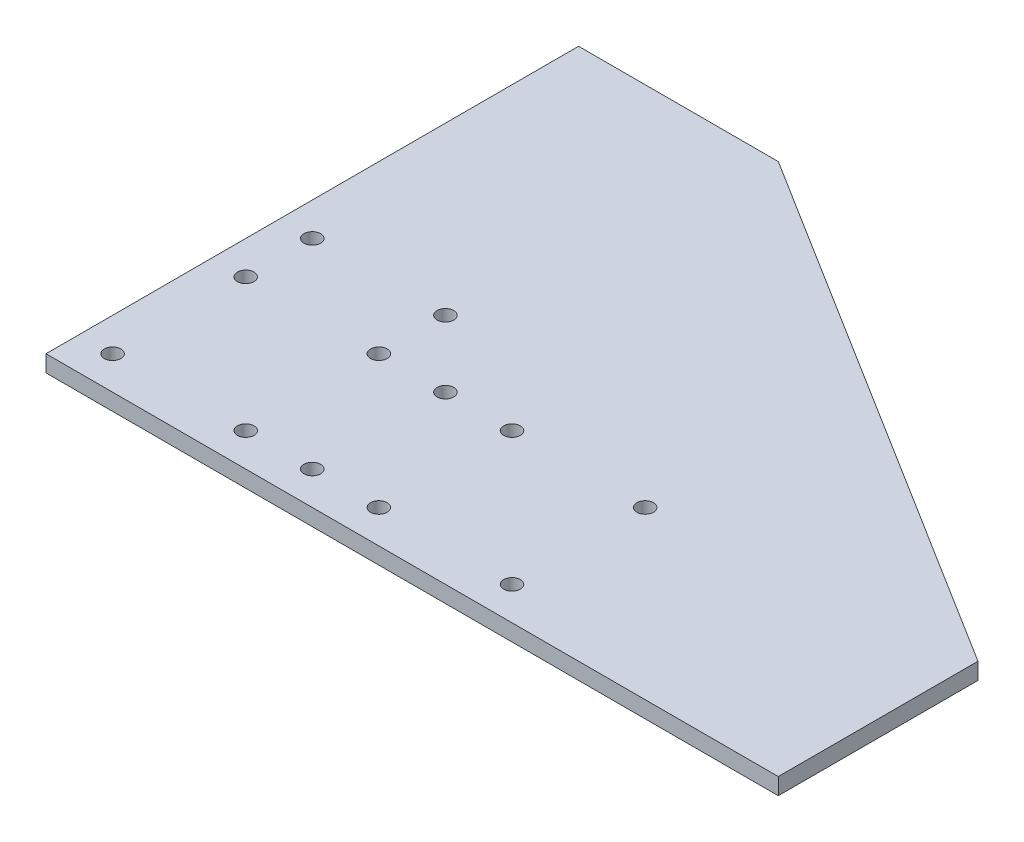
ISO-10303-21;
HEADER;
FILE_DESCRIPTION(('STEP AP214'),'2;1');
FILE_NAME('part.step','',(''),(''),'','','');
FILE_SCHEMA(('AUTOMOTIVE_DESIGN { 1 0 10303 214 1 1 1 1 }'));
ENDSEC;
DATA;
#1=APPLICATION_CONTEXT('core data for automotive mechanical design processes');
#2=APPLICATION_PROTOCOL_DEFINITION('international standard','automotive_design',2000,#1);
#3=PRODUCT_CONTEXT('',#1,'mechanical');
#4=PRODUCT('Part','Part','',(#3));
#5=PRODUCT_RELATED_PRODUCT_CATEGORY('part','',(#4));
#6=PRODUCT_DEFINITION_FORMATION('','',#4);
#7=PRODUCT_DEFINITION_CONTEXT('part definition',#1,'design');
#8=PRODUCT_DEFINITION('design','',#6,#7);
#9=PRODUCT_DEFINITION_SHAPE('','',#8);
#10=(LENGTH_UNIT() NAMED_UNIT(*) SI_UNIT(.MILLI.,.METRE.));
#11=(NAMED_UNIT(*) PLANE_ANGLE_UNIT() SI_UNIT($,.RADIAN.));
#12=(NAMED_UNIT(*) SI_UNIT($,.STERADIAN.) SOLID_ANGLE_UNIT());
#13=UNCERTAINTY_MEASURE_WITH_UNIT(LENGTH_MEASURE(1.E-05),#10,'distance_accuracy_value','');
#14=(GEOMETRIC_REPRESENTATION_CONTEXT(3) GLOBAL_UNCERTAINTY_ASSIGNED_CONTEXT((#13)) GLOBAL_UNIT_ASSIGNED_CONTEXT((#10,
#11,#12)) REPRESENTATION_CONTEXT('',''));
#15=CARTESIAN_POINT('',(0.,0.,0.));
#16=DIRECTION('',(0.,0.,1.));
#17=DIRECTION('',(1.,0.,0.));
#18=AXIS2_PLACEMENT_3D('',#15,#16,#17);
#19=CARTESIAN_POINT('',(0.,3.175,-50.8));
#20=DIRECTION('',(1.,0.,0.));
#21=DIRECTION('',(0.,0.,-1.));
#22=AXIS2_PLACEMENT_3D('',#19,#20,#21);
#23=PLANE('',#22);
#24=DIRECTION('',(0.,0.,1.));
#25=VECTOR('',#24,1.);
#26=CARTESIAN_POINT('',(0.,0.,-50.8));
#27=LINE('',#26,#25);
#28=CARTESIAN_POINT('',(0.,0.,-101.6));
#29=VERTEX_POINT('',#28);
#30=CARTESIAN_POINT('',(0.,0.,0.));
#31=VERTEX_POINT('',#30);
#32=EDGE_CURVE('E180',#29,#31,#27,.T.);
#33=ORIENTED_EDGE('',*,*,#32,.T.);
#34=DIRECTION('',(0.,-1.,0.));
#35=VECTOR('',#34,1.);
#36=CARTESIAN_POINT('',(0.,3.175,0.));
#37=LINE('',#36,#35);
#38=CARTESIAN_POINT('',(0.,3.175,0.));
#39=VERTEX_POINT('',#38);
#40=EDGE_CURVE('E11',#39,#31,#37,.T.);
#41=ORIENTED_EDGE('',*,*,#40,.F.);
#42=DIRECTION('',(0.,0.,1.));
#43=VECTOR('',#42,1.);
#44=CARTESIAN_POINT('',(0.,3.175,-50.8));
#45=LINE('',#44,#43);
#46=CARTESIAN_POINT('',(0.,3.175,-101.6));
#47=VERTEX_POINT('',#46);
#48=EDGE_CURVE('E47',#47,#39,#45,.T.);
#49=ORIENTED_EDGE('',*,*,#48,.F.);
#50=DIRECTION('',(0.,1.,0.));
#51=VECTOR('',#50,1.);
#52=CARTESIAN_POINT('',(0.,-172.73867546094,-101.6));
#53=LINE('',#52,#51);
#54=EDGE_CURVE('E103',#29,#47,#53,.T.);
#55=ORIENTED_EDGE('',*,*,#54,.F.);
#56=EDGE_LOOP('',(#33,#41,#49,#55));
#57=FACE_BOUND('',#56,.T.);
#58=ADVANCED_FACE('F33',(#57),#23,.F.);
#59=CARTESIAN_POINT('',(0.,3.175,0.));
#60=DIRECTION('',(0.,0.,-1.));
#61=DIRECTION('',(-1.,0.,0.));
#62=AXIS2_PLACEMENT_3D('',#59,#60,#61);
#63=PLANE('',#62);
#64=DIRECTION('',(1.,0.,0.));
#65=VECTOR('',#64,1.);
#66=CARTESIAN_POINT('',(0.,0.,0.));
#67=LINE('',#66,#65);
#68=CARTESIAN_POINT('',(139.7,0.,0.));
#69=VERTEX_POINT('',#68);
#70=EDGE_CURVE('E85',#31,#69,#67,.T.);
#71=ORIENTED_EDGE('',*,*,#70,.T.);
#72=DIRECTION('',(0.,1.,0.));
#73=VECTOR('',#72,1.);
#74=CARTESIAN_POINT('',(139.7,-172.73867546094,0.));
#75=LINE('',#74,#73);
#76=CARTESIAN_POINT('',(139.7,3.175,0.));
#77=VERTEX_POINT('',#76);
#78=EDGE_CURVE('E82',#69,#77,#75,.T.);
#79=ORIENTED_EDGE('',*,*,#78,.T.);
#80=DIRECTION('',(1.,0.,0.));
#81=VECTOR('',#80,1.);
#82=CARTESIAN_POINT('',(0.,3.175,0.));
#83=LINE('',#82,#81);
#84=EDGE_CURVE('E41',#39,#77,#83,.T.);
#85=ORIENTED_EDGE('',*,*,#84,.F.);
#86=ORIENTED_EDGE('',*,*,#40,.T.);
#87=EDGE_LOOP('',(#71,#79,#85,#86));
#88=FACE_BOUND('',#87,.T.);
#89=ADVANCED_FACE('F83',(#88),#63,.F.);
#90=CARTESIAN_POINT('',(0.,3.175,0.));
#91=DIRECTION('',(0.,1.,0.));
#92=DIRECTION('',(0.,0.,1.));
#93=AXIS2_PLACEMENT_3D('',#90,#91,#92);
#94=PLANE('',#93);
#95=CARTESIAN_POINT('',(57.15,3.175,-31.75));
#96=DIRECTION('',(0.,1.,0.));
#97=DIRECTION('',(0.,0.,1.));
#98=AXIS2_PLACEMENT_3D('',#95,#96,#97);
#99=CIRCLE('',#98,1.5875);
#100=CARTESIAN_POINT('',(57.15,3.175,-30.1625));
#101=VERTEX_POINT('',#100);
#102=EDGE_CURVE('E113',#101,#101,#99,.T.);
#103=ORIENTED_EDGE('',*,*,#102,.F.);
#104=EDGE_LOOP('',(#103));
#105=FACE_BOUND('',#104,.T.);
#106=CARTESIAN_POINT('',(82.55,3.175,-31.75));
#107=DIRECTION('',(0.,1.,0.));
#108=DIRECTION('',(0.,0.,1.));
#109=AXIS2_PLACEMENT_3D('',#106,#107,#108);
#110=CIRCLE('',#109,1.5875);
#111=CARTESIAN_POINT('',(82.55,3.175,-30.1625));
#112=VERTEX_POINT('',#111);
#113=EDGE_CURVE('E145',#112,#112,#110,.T.);
#114=ORIENTED_EDGE('',*,*,#113,.F.);
#115=EDGE_LOOP('',(#114));
#116=FACE_BOUND('',#115,.T.);
#117=CARTESIAN_POINT('',(82.55,3.175,-6.35));
#118=DIRECTION('',(0.,1.,0.));
#119=DIRECTION('',(0.,0.,1.));
#120=AXIS2_PLACEMENT_3D('',#117,#118,#119);
#121=CIRCLE('',#120,1.5875);
#122=CARTESIAN_POINT('',(82.55,3.175,-4.7625));
#123=VERTEX_POINT('',#122);
#124=EDGE_CURVE('E139',#123,#123,#121,.T.);
#125=ORIENTED_EDGE('',*,*,#124,.F.);
#126=EDGE_LOOP('',(#125));
#127=FACE_BOUND('',#126,.T.);
#128=CARTESIAN_POINT('',(31.75,3.175,-6.35));
#129=DIRECTION('',(0.,1.,0.));
#130=DIRECTION('',(0.,0.,1.));
#131=AXIS2_PLACEMENT_3D('',#128,#129,#130);
#132=CIRCLE('',#131,1.5875);
#133=CARTESIAN_POINT('',(31.75,3.175,-4.7625));
#134=VERTEX_POINT('',#133);
#135=EDGE_CURVE('E133',#134,#134,#132,.T.);
#136=ORIENTED_EDGE('',*,*,#135,.F.);
#137=EDGE_LOOP('',(#136));
#138=FACE_BOUND('',#137,.T.);
#139=CARTESIAN_POINT('',(6.35000000000001,3.175,-6.35));
#140=DIRECTION('',(0.,1.,0.));
#141=DIRECTION('',(0.,0.,1.));
#142=AXIS2_PLACEMENT_3D('',#139,#140,#141);
#143=CIRCLE('',#142,1.5875);
#144=CARTESIAN_POINT('',(6.35000000000001,3.175,-4.7625));
#145=VERTEX_POINT('',#144);
#146=EDGE_CURVE('E132',#145,#145,#143,.T.);
#147=ORIENTED_EDGE('',*,*,#146,.F.);
#148=EDGE_LOOP('',(#147));
#149=FACE_BOUND('',#148,.T.);
#150=CARTESIAN_POINT('',(6.35000000000001,3.175,-31.75));
#151=DIRECTION('',(0.,1.,0.));
#152=DIRECTION('',(0.,0.,1.));
#153=AXIS2_PLACEMENT_3D('',#150,#151,#152);
#154=CIRCLE('',#153,1.5875);
#155=CARTESIAN_POINT('',(6.35000000000001,3.175,-30.1625));
#156=VERTEX_POINT('',#155);
#157=EDGE_CURVE('E169',#156,#156,#154,.T.);
#158=ORIENTED_EDGE('',*,*,#157,.F.);
#159=EDGE_LOOP('',(#158));
#160=FACE_BOUND('',#159,.T.);
#161=CARTESIAN_POINT('',(31.75,3.175,-31.75));
#162=DIRECTION('',(0.,1.,0.));
#163=DIRECTION('',(0.,0.,1.));
#164=AXIS2_PLACEMENT_3D('',#161,#162,#163);
#165=CIRCLE('',#164,1.5875);
#166=CARTESIAN_POINT('',(31.75,3.175,-30.1625));
#167=VERTEX_POINT('',#166);
#168=EDGE_CURVE('E163',#167,#167,#165,.T.);
#169=ORIENTED_EDGE('',*,*,#168,.F.);
#170=EDGE_LOOP('',(#169));
#171=FACE_BOUND('',#170,.T.);
#172=CARTESIAN_POINT('',(31.75,3.175,-44.45));
#173=DIRECTION('',(0.,1.,0.));
#174=DIRECTION('',(0.,0.,1.));
#175=AXIS2_PLACEMENT_3D('',#172,#173,#174);
#176=CIRCLE('',#175,1.5875);
#177=CARTESIAN_POINT('',(31.75,3.175,-42.8625));
#178=VERTEX_POINT('',#177);
#179=EDGE_CURVE('E157',#178,#178,#176,.T.);
#180=ORIENTED_EDGE('',*,*,#179,.F.);
#181=EDGE_LOOP('',(#180));
#182=FACE_BOUND('',#181,.T.);
#183=CARTESIAN_POINT('',(57.15,3.175,-6.35));
#184=DIRECTION('',(0.,1.,0.));
#185=DIRECTION('',(0.,0.,1.));
#186=AXIS2_PLACEMENT_3D('',#183,#184,#185);
#187=CIRCLE('',#186,1.5875);
#188=CARTESIAN_POINT('',(57.15,3.175,-4.7625));
#189=VERTEX_POINT('',#188);
#190=EDGE_CURVE('E114',#189,#189,#187,.T.);
#191=ORIENTED_EDGE('',*,*,#190,.F.);
#192=EDGE_LOOP('',(#191));
#193=FACE_BOUND('',#192,.T.);
#194=CARTESIAN_POINT('',(44.45,3.175,-6.35));
#195=DIRECTION('',(0.,1.,0.));
#196=DIRECTION('',(0.,0.,1.));
#197=AXIS2_PLACEMENT_3D('',#194,#195,#196);
#198=CIRCLE('',#197,1.5875);
#199=CARTESIAN_POINT('',(44.45,3.175,-4.7625));
#200=VERTEX_POINT('',#199);
#201=EDGE_CURVE('E120',#200,#200,#198,.T.);
#202=ORIENTED_EDGE('',*,*,#201,.F.);
#203=EDGE_LOOP('',(#202));
#204=FACE_BOUND('',#203,.T.);
#205=CARTESIAN_POINT('',(44.45,3.175,-31.75));
#206=DIRECTION('',(0.,1.,0.));
#207=DIRECTION('',(0.,0.,1.));
#208=AXIS2_PLACEMENT_3D('',#205,#206,#207);
#209=CIRCLE('',#208,1.5875);
#210=CARTESIAN_POINT('',(44.45,3.175,-30.1625));
#211=VERTEX_POINT('',#210);
#212=EDGE_CURVE('E126',#211,#211,#209,.T.);
#213=ORIENTED_EDGE('',*,*,#212,.F.);
#214=EDGE_LOOP('',(#213));
#215=FACE_BOUND('',#214,.T.);
#216=CARTESIAN_POINT('',(6.35,3.175,-44.45));
#217=DIRECTION('',(0.,1.,0.));
#218=DIRECTION('',(0.,0.,1.));
#219=AXIS2_PLACEMENT_3D('',#216,#217,#218);
#220=CIRCLE('',#219,1.5875);
#221=CARTESIAN_POINT('',(6.35,3.175,-42.8625));
#222=VERTEX_POINT('',#221);
#223=EDGE_CURVE('E156',#222,#222,#220,.T.);
#224=ORIENTED_EDGE('',*,*,#223,.F.);
#225=EDGE_LOOP('',(#224));
#226=FACE_BOUND('',#225,.T.);
#227=ORIENTED_EDGE('',*,*,#84,.T.);
#228=DIRECTION('',(0.,0.,-1.));
#229=VECTOR('',#228,1.);
#230=CARTESIAN_POINT('',(139.7,3.175,-38.1));
#231=LINE('',#230,#229);
#232=CARTESIAN_POINT('',(139.7,3.175,-38.1));
#233=VERTEX_POINT('',#232);
#234=EDGE_CURVE('E78',#77,#233,#231,.T.);
#235=ORIENTED_EDGE('',*,*,#234,.T.);
#236=DIRECTION('',(-0.847998304005088,0.,-0.52999894000318));
#237=VECTOR('',#236,1.);
#238=CARTESIAN_POINT('',(38.1,3.175,-101.6));
#239=LINE('',#238,#237);
#240=CARTESIAN_POINT('',(38.1,3.175,-101.6));
#241=VERTEX_POINT('',#240);
#242=EDGE_CURVE('E95',#233,#241,#239,.T.);
#243=ORIENTED_EDGE('',*,*,#242,.T.);
#244=DIRECTION('',(-1.,0.,0.));
#245=VECTOR('',#244,1.);
#246=CARTESIAN_POINT('',(0.,3.175,-101.6));
#247=LINE('',#246,#245);
#248=EDGE_CURVE('E90',#241,#47,#247,.T.);
#249=ORIENTED_EDGE('',*,*,#248,.T.);
#250=ORIENTED_EDGE('',*,*,#48,.T.);
#251=EDGE_LOOP('',(#227,#235,#243,#249,#250));
#252=FACE_BOUND('',#251,.T.);
#253=ADVANCED_FACE('F75',(#105,#116,#127,#138,#149,#160,#171,#182,#193,#204,#215,#226,#252),#94,.T.);
#254=CARTESIAN_POINT('',(0.,0.,0.));
#255=DIRECTION('',(0.,1.,0.));
#256=DIRECTION('',(0.,0.,1.));
#257=AXIS2_PLACEMENT_3D('',#254,#255,#256);
#258=PLANE('',#257);
#259=CARTESIAN_POINT('',(57.15,0.,-31.75));
#260=DIRECTION('',(0.,1.,0.));
#261=DIRECTION('',(0.,0.,1.));
#262=AXIS2_PLACEMENT_3D('',#259,#260,#261);
#263=CIRCLE('',#262,1.5875);
#264=CARTESIAN_POINT('',(57.15,0.,-30.1625));
#265=VERTEX_POINT('',#264);
#266=EDGE_CURVE('E148',#265,#265,#263,.T.);
#267=ORIENTED_EDGE('',*,*,#266,.T.);
#268=EDGE_LOOP('',(#267));
#269=FACE_BOUND('',#268,.T.);
#270=CARTESIAN_POINT('',(82.55,0.,-31.75));
#271=DIRECTION('',(0.,1.,0.));
#272=DIRECTION('',(0.,0.,1.));
#273=AXIS2_PLACEMENT_3D('',#270,#271,#272);
#274=CIRCLE('',#273,1.5875);
#275=CARTESIAN_POINT('',(82.55,0.,-30.1625));
#276=VERTEX_POINT('',#275);
#277=EDGE_CURVE('E142',#276,#276,#274,.T.);
#278=ORIENTED_EDGE('',*,*,#277,.T.);
#279=EDGE_LOOP('',(#278));
#280=FACE_BOUND('',#279,.T.);
#281=CARTESIAN_POINT('',(82.55,0.,-6.35));
#282=DIRECTION('',(0.,1.,0.));
#283=DIRECTION('',(0.,0.,1.));
#284=AXIS2_PLACEMENT_3D('',#281,#282,#283);
#285=CIRCLE('',#284,1.5875);
#286=CARTESIAN_POINT('',(82.55,0.,-4.7625));
#287=VERTEX_POINT('',#286);
#288=EDGE_CURVE('E136',#287,#287,#285,.T.);
#289=ORIENTED_EDGE('',*,*,#288,.T.);
#290=EDGE_LOOP('',(#289));
#291=FACE_BOUND('',#290,.T.);
#292=CARTESIAN_POINT('',(31.75,0.,-6.35));
#293=DIRECTION('',(0.,1.,0.));
#294=DIRECTION('',(0.,0.,1.));
#295=AXIS2_PLACEMENT_3D('',#292,#293,#294);
#296=CIRCLE('',#295,1.5875);
#297=CARTESIAN_POINT('',(31.75,0.,-4.7625));
#298=VERTEX_POINT('',#297);
#299=EDGE_CURVE('E129',#298,#298,#296,.T.);
#300=ORIENTED_EDGE('',*,*,#299,.T.);
#301=EDGE_LOOP('',(#300));
#302=FACE_BOUND('',#301,.T.);
#303=CARTESIAN_POINT('',(6.35000000000001,0.,-6.35));
#304=DIRECTION('',(0.,1.,0.));
#305=DIRECTION('',(0.,0.,1.));
#306=AXIS2_PLACEMENT_3D('',#303,#304,#305);
#307=CIRCLE('',#306,1.5875);
#308=CARTESIAN_POINT('',(6.35000000000001,0.,-4.7625));
#309=VERTEX_POINT('',#308);
#310=EDGE_CURVE('E172',#309,#309,#307,.T.);
#311=ORIENTED_EDGE('',*,*,#310,.T.);
#312=EDGE_LOOP('',(#311));
#313=FACE_BOUND('',#312,.T.);
#314=CARTESIAN_POINT('',(6.35000000000001,0.,-31.75));
#315=DIRECTION('',(0.,1.,0.));
#316=DIRECTION('',(0.,0.,1.));
#317=AXIS2_PLACEMENT_3D('',#314,#315,#316);
#318=CIRCLE('',#317,1.5875);
#319=CARTESIAN_POINT('',(6.35000000000001,0.,-30.1625));
#320=VERTEX_POINT('',#319);
#321=EDGE_CURVE('E166',#320,#320,#318,.T.);
#322=ORIENTED_EDGE('',*,*,#321,.T.);
#323=EDGE_LOOP('',(#322));
#324=FACE_BOUND('',#323,.T.);
#325=CARTESIAN_POINT('',(31.75,0.,-31.75));
#326=DIRECTION('',(0.,1.,0.));
#327=DIRECTION('',(0.,0.,1.));
#328=AXIS2_PLACEMENT_3D('',#325,#326,#327);
#329=CIRCLE('',#328,1.5875);
#330=CARTESIAN_POINT('',(31.75,0.,-30.1625));
#331=VERTEX_POINT('',#330);
#332=EDGE_CURVE('E160',#331,#331,#329,.T.);
#333=ORIENTED_EDGE('',*,*,#332,.T.);
#334=EDGE_LOOP('',(#333));
#335=FACE_BOUND('',#334,.T.);
#336=CARTESIAN_POINT('',(31.75,0.,-44.45));
#337=DIRECTION('',(0.,1.,0.));
#338=DIRECTION('',(0.,0.,1.));
#339=AXIS2_PLACEMENT_3D('',#336,#337,#338);
#340=CIRCLE('',#339,1.5875);
#341=CARTESIAN_POINT('',(31.75,0.,-42.8625));
#342=VERTEX_POINT('',#341);
#343=EDGE_CURVE('E153',#342,#342,#340,.T.);
#344=ORIENTED_EDGE('',*,*,#343,.T.);
#345=EDGE_LOOP('',(#344));
#346=FACE_BOUND('',#345,.T.);
#347=CARTESIAN_POINT('',(57.15,0.,-6.35));
#348=DIRECTION('',(0.,1.,0.));
#349=DIRECTION('',(0.,0.,1.));
#350=AXIS2_PLACEMENT_3D('',#347,#348,#349);
#351=CIRCLE('',#350,1.5875);
#352=CARTESIAN_POINT('',(57.15,0.,-4.7625));
#353=VERTEX_POINT('',#352);
#354=EDGE_CURVE('E110',#353,#353,#351,.T.);
#355=ORIENTED_EDGE('',*,*,#354,.T.);
#356=EDGE_LOOP('',(#355));
#357=FACE_BOUND('',#356,.T.);
#358=CARTESIAN_POINT('',(44.45,0.,-6.35));
#359=DIRECTION('',(0.,1.,0.));
#360=DIRECTION('',(0.,0.,1.));
#361=AXIS2_PLACEMENT_3D('',#358,#359,#360);
#362=CIRCLE('',#361,1.5875);
#363=CARTESIAN_POINT('',(44.45,0.,-4.7625));
#364=VERTEX_POINT('',#363);
#365=EDGE_CURVE('E117',#364,#364,#362,.T.);
#366=ORIENTED_EDGE('',*,*,#365,.T.);
#367=EDGE_LOOP('',(#366));
#368=FACE_BOUND('',#367,.T.);
#369=CARTESIAN_POINT('',(44.45,0.,-31.75));
#370=DIRECTION('',(0.,1.,0.));
#371=DIRECTION('',(0.,0.,1.));
#372=AXIS2_PLACEMENT_3D('',#369,#370,#371);
#373=CIRCLE('',#372,1.5875);
#374=CARTESIAN_POINT('',(44.45,0.,-30.1625));
#375=VERTEX_POINT('',#374);
#376=EDGE_CURVE('E123',#375,#375,#373,.T.);
#377=ORIENTED_EDGE('',*,*,#376,.T.);
#378=EDGE_LOOP('',(#377));
#379=FACE_BOUND('',#378,.T.);
#380=CARTESIAN_POINT('',(6.35,0.,-44.45));
#381=DIRECTION('',(0.,1.,0.));
#382=DIRECTION('',(0.,0.,1.));
#383=AXIS2_PLACEMENT_3D('',#380,#381,#382);
#384=CIRCLE('',#383,1.5875);
#385=CARTESIAN_POINT('',(6.35,0.,-42.8625));
#386=VERTEX_POINT('',#385);
#387=EDGE_CURVE('E177',#386,#386,#384,.T.);
#388=ORIENTED_EDGE('',*,*,#387,.T.);
#389=EDGE_LOOP('',(#388));
#390=FACE_BOUND('',#389,.T.);
#391=ORIENTED_EDGE('',*,*,#32,.F.);
#392=DIRECTION('',(1.,0.,0.));
#393=VECTOR('',#392,1.);
#394=CARTESIAN_POINT('',(0.,0.,-101.6));
#395=LINE('',#394,#393);
#396=CARTESIAN_POINT('',(38.1,0.,-101.6));
#397=VERTEX_POINT('',#396);
#398=EDGE_CURVE('E99',#29,#397,#395,.T.);
#399=ORIENTED_EDGE('',*,*,#398,.T.);
#400=DIRECTION('',(0.847998304005088,0.,0.52999894000318));
#401=VECTOR('',#400,1.);
#402=CARTESIAN_POINT('',(38.1,0.,-101.6));
#403=LINE('',#402,#401);
#404=CARTESIAN_POINT('',(139.7,0.,-38.1));
#405=VERTEX_POINT('',#404);
#406=EDGE_CURVE('E190',#397,#405,#403,.T.);
#407=ORIENTED_EDGE('',*,*,#406,.T.);
#408=DIRECTION('',(0.,0.,1.));
#409=VECTOR('',#408,1.);
#410=CARTESIAN_POINT('',(139.7,0.,-38.1));
#411=LINE('',#410,#409);
#412=EDGE_CURVE('E106',#405,#69,#411,.T.);
#413=ORIENTED_EDGE('',*,*,#412,.T.);
#414=ORIENTED_EDGE('',*,*,#70,.F.);
#415=EDGE_LOOP('',(#391,#399,#407,#413,#414));
#416=FACE_BOUND('',#415,.T.);
#417=ADVANCED_FACE('F188',(#269,#280,#291,#302,#313,#324,#335,#346,#357,#368,#379,#390,#416),
#258,.F.);
#418=CARTESIAN_POINT('',(6.35,0.,-44.45));
#419=DIRECTION('',(0.,1.,0.));
#420=DIRECTION('',(0.,0.,1.));
#421=AXIS2_PLACEMENT_3D('',#418,#419,#420);
#422=CYLINDRICAL_SURFACE('',#421,1.5875);
#423=ORIENTED_EDGE('',*,*,#387,.F.);
#424=EDGE_LOOP('',(#423));
#425=FACE_BOUND('',#424,.T.);
#426=ORIENTED_EDGE('',*,*,#223,.T.);
#427=EDGE_LOOP('',(#426));
#428=FACE_BOUND('',#427,.T.);
#429=ADVANCED_FACE('F220',(#425,#428),#422,.F.);
#430=CARTESIAN_POINT('',(44.45,0.,-31.75));
#431=DIRECTION('',(0.,1.,0.));
#432=DIRECTION('',(0.,0.,1.));
#433=AXIS2_PLACEMENT_3D('',#430,#431,#432);
#434=CYLINDRICAL_SURFACE('',#433,1.5875);
#435=ORIENTED_EDGE('',*,*,#376,.F.);
#436=EDGE_LOOP('',(#435));
#437=FACE_BOUND('',#436,.T.);
#438=ORIENTED_EDGE('',*,*,#212,.T.);
#439=EDGE_LOOP('',(#438));
#440=FACE_BOUND('',#439,.T.);
#441=ADVANCED_FACE('F225',(#437,#440),#434,.F.);
#442=CARTESIAN_POINT('',(44.45,0.,-6.35));
#443=DIRECTION('',(0.,1.,0.));
#444=DIRECTION('',(0.,0.,1.));
#445=AXIS2_PLACEMENT_3D('',#442,#443,#444);
#446=CYLINDRICAL_SURFACE('',#445,1.5875);
#447=ORIENTED_EDGE('',*,*,#365,.F.);
#448=EDGE_LOOP('',(#447));
#449=FACE_BOUND('',#448,.T.);
#450=ORIENTED_EDGE('',*,*,#201,.T.);
#451=EDGE_LOOP('',(#450));
#452=FACE_BOUND('',#451,.T.);
#453=ADVANCED_FACE('F257',(#449,#452),#446,.F.);
#454=CARTESIAN_POINT('',(57.15,0.,-6.35));
#455=DIRECTION('',(0.,1.,0.));
#456=DIRECTION('',(0.,0.,1.));
#457=AXIS2_PLACEMENT_3D('',#454,#455,#456);
#458=CYLINDRICAL_SURFACE('',#457,1.5875);
#459=ORIENTED_EDGE('',*,*,#354,.F.);
#460=EDGE_LOOP('',(#459));
#461=FACE_BOUND('',#460,.T.);
#462=ORIENTED_EDGE('',*,*,#190,.T.);
#463=EDGE_LOOP('',(#462));
#464=FACE_BOUND('',#463,.T.);
#465=ADVANCED_FACE('F242',(#461,#464),#458,.F.);
#466=CARTESIAN_POINT('',(31.75,0.,-44.45));
#467=DIRECTION('',(0.,1.,0.));
#468=DIRECTION('',(0.,0.,1.));
#469=AXIS2_PLACEMENT_3D('',#466,#467,#468);
#470=CYLINDRICAL_SURFACE('',#469,1.5875);
#471=ORIENTED_EDGE('',*,*,#343,.F.);
#472=EDGE_LOOP('',(#471));
#473=FACE_BOUND('',#472,.T.);
#474=ORIENTED_EDGE('',*,*,#179,.T.);
#475=EDGE_LOOP('',(#474));
#476=FACE_BOUND('',#475,.T.);
#477=ADVANCED_FACE('F239',(#473,#476),#470,.F.);
#478=CARTESIAN_POINT('',(31.75,0.,-31.75));
#479=DIRECTION('',(0.,1.,0.));
#480=DIRECTION('',(0.,0.,1.));
#481=AXIS2_PLACEMENT_3D('',#478,#479,#480);
#482=CYLINDRICAL_SURFACE('',#481,1.5875);
#483=ORIENTED_EDGE('',*,*,#332,.F.);
#484=EDGE_LOOP('',(#483));
#485=FACE_BOUND('',#484,.T.);
#486=ORIENTED_EDGE('',*,*,#168,.T.);
#487=EDGE_LOOP('',(#486));
#488=FACE_BOUND('',#487,.T.);
#489=ADVANCED_FACE('F235',(#485,#488),#482,.F.);
#490=CARTESIAN_POINT('',(6.35000000000001,0.,-31.75));
#491=DIRECTION('',(0.,1.,0.));
#492=DIRECTION('',(0.,0.,1.));
#493=AXIS2_PLACEMENT_3D('',#490,#491,#492);
#494=CYLINDRICAL_SURFACE('',#493,1.5875);
#495=ORIENTED_EDGE('',*,*,#321,.F.);
#496=EDGE_LOOP('',(#495));
#497=FACE_BOUND('',#496,.T.);
#498=ORIENTED_EDGE('',*,*,#157,.T.);
#499=EDGE_LOOP('',(#498));
#500=FACE_BOUND('',#499,.T.);
#501=ADVANCED_FACE('F231',(#497,#500),#494,.F.);
#502=CARTESIAN_POINT('',(6.35000000000001,0.,-6.35));
#503=DIRECTION('',(0.,1.,0.));
#504=DIRECTION('',(0.,0.,1.));
#505=AXIS2_PLACEMENT_3D('',#502,#503,#504);
#506=CYLINDRICAL_SURFACE('',#505,1.5875);
#507=ORIENTED_EDGE('',*,*,#310,.F.);
#508=EDGE_LOOP('',(#507));
#509=FACE_BOUND('',#508,.T.);
#510=ORIENTED_EDGE('',*,*,#146,.T.);
#511=EDGE_LOOP('',(#510));
#512=FACE_BOUND('',#511,.T.);
#513=ADVANCED_FACE('F227',(#509,#512),#506,.F.);
#514=CARTESIAN_POINT('',(31.75,0.,-6.35));
#515=DIRECTION('',(0.,1.,0.));
#516=DIRECTION('',(0.,0.,1.));
#517=AXIS2_PLACEMENT_3D('',#514,#515,#516);
#518=CYLINDRICAL_SURFACE('',#517,1.5875);
#519=ORIENTED_EDGE('',*,*,#299,.F.);
#520=EDGE_LOOP('',(#519));
#521=FACE_BOUND('',#520,.T.);
#522=ORIENTED_EDGE('',*,*,#135,.T.);
#523=EDGE_LOOP('',(#522));
#524=FACE_BOUND('',#523,.T.);
#525=ADVANCED_FACE('F230',(#521,#524),#518,.F.);
#526=CARTESIAN_POINT('',(82.55,0.,-6.35));
#527=DIRECTION('',(0.,1.,0.));
#528=DIRECTION('',(0.,0.,1.));
#529=AXIS2_PLACEMENT_3D('',#526,#527,#528);
#530=CYLINDRICAL_SURFACE('',#529,1.5875);
#531=ORIENTED_EDGE('',*,*,#288,.F.);
#532=EDGE_LOOP('',(#531));
#533=FACE_BOUND('',#532,.T.);
#534=ORIENTED_EDGE('',*,*,#124,.T.);
#535=EDGE_LOOP('',(#534));
#536=FACE_BOUND('',#535,.T.);
#537=ADVANCED_FACE('F247',(#533,#536),#530,.F.);
#538=CARTESIAN_POINT('',(82.55,0.,-31.75));
#539=DIRECTION('',(0.,1.,0.));
#540=DIRECTION('',(0.,0.,1.));
#541=AXIS2_PLACEMENT_3D('',#538,#539,#540);
#542=CYLINDRICAL_SURFACE('',#541,1.5875);
#543=ORIENTED_EDGE('',*,*,#277,.F.);
#544=EDGE_LOOP('',(#543));
#545=FACE_BOUND('',#544,.T.);
#546=ORIENTED_EDGE('',*,*,#113,.T.);
#547=EDGE_LOOP('',(#546));
#548=FACE_BOUND('',#547,.T.);
#549=ADVANCED_FACE('F207',(#545,#548),#542,.F.);
#550=CARTESIAN_POINT('',(57.15,0.,-31.75));
#551=DIRECTION('',(0.,1.,0.));
#552=DIRECTION('',(0.,0.,1.));
#553=AXIS2_PLACEMENT_3D('',#550,#551,#552);
#554=CYLINDRICAL_SURFACE('',#553,1.5875);
#555=ORIENTED_EDGE('',*,*,#266,.F.);
#556=EDGE_LOOP('',(#555));
#557=FACE_BOUND('',#556,.T.);
#558=ORIENTED_EDGE('',*,*,#102,.T.);
#559=EDGE_LOOP('',(#558));
#560=FACE_BOUND('',#559,.T.);
#561=ADVANCED_FACE('F199',(#557,#560),#554,.F.);
#562=CARTESIAN_POINT('',(0.,-172.73867546094,-101.6));
#563=DIRECTION('',(0.,0.,-1.));
#564=DIRECTION('',(-1.,0.,0.));
#565=AXIS2_PLACEMENT_3D('',#562,#563,#564);
#566=PLANE('',#565);
#567=ORIENTED_EDGE('',*,*,#398,.F.);
#568=ORIENTED_EDGE('',*,*,#54,.T.);
#569=ORIENTED_EDGE('',*,*,#248,.F.);
#570=DIRECTION('',(0.,1.,0.));
#571=VECTOR('',#570,1.);
#572=CARTESIAN_POINT('',(38.1,-172.73867546094,-101.6));
#573=LINE('',#572,#571);
#574=EDGE_CURVE('E107',#397,#241,#573,.T.);
#575=ORIENTED_EDGE('',*,*,#574,.F.);
#576=EDGE_LOOP('',(#567,#568,#569,#575));
#577=FACE_BOUND('',#576,.T.);
#578=ADVANCED_FACE('F197',(#577),#566,.T.);
#579=CARTESIAN_POINT('',(38.1,-172.73867546094,-101.6));
#580=DIRECTION('',(0.52999894000318,0.,-0.847998304005088));
#581=DIRECTION('',(-0.847998304005088,0.,-0.52999894000318));
#582=AXIS2_PLACEMENT_3D('',#579,#580,#581);
#583=PLANE('',#582);
#584=ORIENTED_EDGE('',*,*,#406,.F.);
#585=ORIENTED_EDGE('',*,*,#574,.T.);
#586=ORIENTED_EDGE('',*,*,#242,.F.);
#587=DIRECTION('',(0.,1.,0.));
#588=VECTOR('',#587,1.);
#589=CARTESIAN_POINT('',(139.7,-172.73867546094,-38.1));
#590=LINE('',#589,#588);
#591=EDGE_CURVE('E89',#405,#233,#590,.T.);
#592=ORIENTED_EDGE('',*,*,#591,.F.);
#593=EDGE_LOOP('',(#584,#585,#586,#592));
#594=FACE_BOUND('',#593,.T.);
#595=ADVANCED_FACE('F195',(#594),#583,.T.);
#596=CARTESIAN_POINT('',(139.7,-172.73867546094,-38.1));
#597=DIRECTION('',(1.,0.,0.));
#598=DIRECTION('',(0.,0.,-1.));
#599=AXIS2_PLACEMENT_3D('',#596,#597,#598);
#600=PLANE('',#599);
#601=ORIENTED_EDGE('',*,*,#412,.F.);
#602=ORIENTED_EDGE('',*,*,#591,.T.);
#603=ORIENTED_EDGE('',*,*,#234,.F.);
#604=ORIENTED_EDGE('',*,*,#78,.F.);
#605=EDGE_LOOP('',(#601,#602,#603,#604));
#606=FACE_BOUND('',#605,.T.);
#607=ADVANCED_FACE('F92',(#606),#600,.T.);
#608=CLOSED_SHELL('',(#58,#89,#253,#417,#429,#441,#453,#465,#477,#489,#501,#513,#525,#537,#549,
#561,#578,#595,#607));
#609=MANIFOLD_SOLID_BREP('B2',#608);
#610=ADVANCED_BREP_SHAPE_REPRESENTATION('',(#18,#609),#14);
#611=SHAPE_DEFINITION_REPRESENTATION(#9,#610);
ENDSEC;
END-ISO-10303-21;
